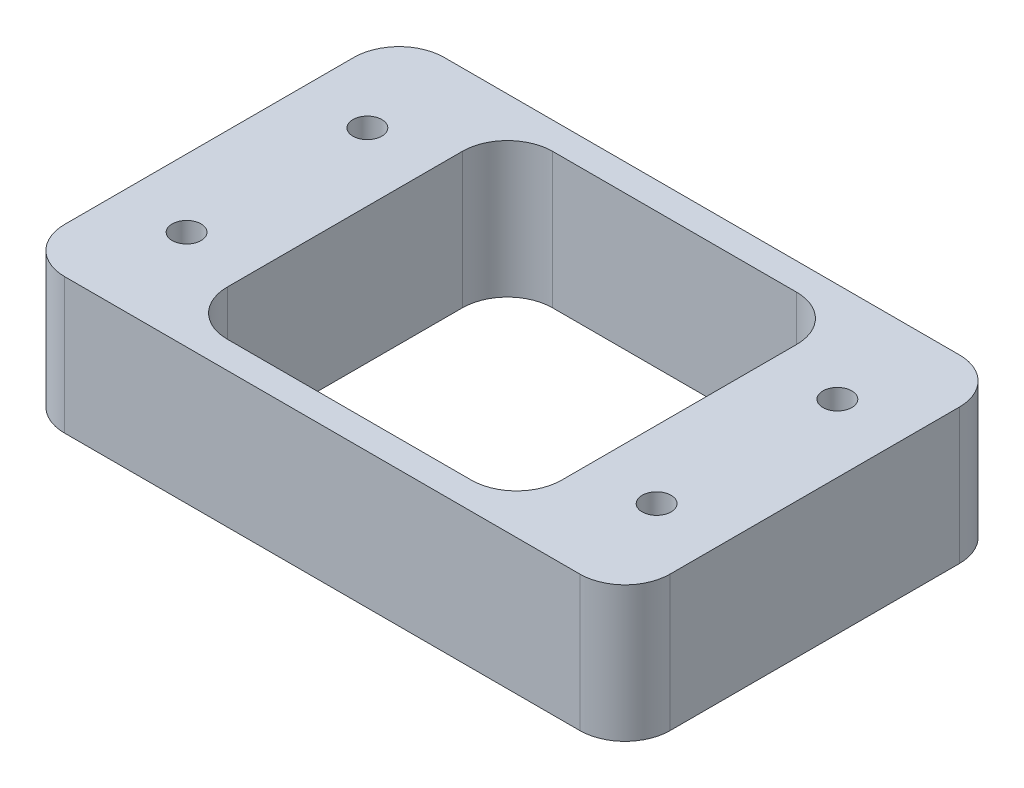
ISO-10303-21;
HEADER;
FILE_DESCRIPTION(('STEP AP214'),'2;1');
FILE_NAME('part.step','',(''),(''),'','','');
FILE_SCHEMA(('AUTOMOTIVE_DESIGN { 1 0 10303 214 1 1 1 1 }'));
ENDSEC;
DATA;
#1=APPLICATION_CONTEXT('core data for automotive mechanical design processes');
#2=APPLICATION_PROTOCOL_DEFINITION('international standard','automotive_design',2000,#1);
#3=PRODUCT_CONTEXT('',#1,'mechanical');
#4=PRODUCT('Part','Part','',(#3));
#5=PRODUCT_RELATED_PRODUCT_CATEGORY('part','',(#4));
#6=PRODUCT_DEFINITION_FORMATION('','',#4);
#7=PRODUCT_DEFINITION_CONTEXT('part definition',#1,'design');
#8=PRODUCT_DEFINITION('design','',#6,#7);
#9=PRODUCT_DEFINITION_SHAPE('','',#8);
#10=(LENGTH_UNIT() NAMED_UNIT(*) SI_UNIT(.MILLI.,.METRE.));
#11=(NAMED_UNIT(*) PLANE_ANGLE_UNIT() SI_UNIT($,.RADIAN.));
#12=(NAMED_UNIT(*) SI_UNIT($,.STERADIAN.) SOLID_ANGLE_UNIT());
#13=UNCERTAINTY_MEASURE_WITH_UNIT(LENGTH_MEASURE(1.E-05),#10,'distance_accuracy_value','');
#14=(GEOMETRIC_REPRESENTATION_CONTEXT(3) GLOBAL_UNCERTAINTY_ASSIGNED_CONTEXT((#13)) GLOBAL_UNIT_ASSIGNED_CONTEXT((#10,
#11,#12)) REPRESENTATION_CONTEXT('',''));
#15=CARTESIAN_POINT('',(0.,0.,0.));
#16=DIRECTION('',(0.,0.,1.));
#17=DIRECTION('',(1.,0.,0.));
#18=AXIS2_PLACEMENT_3D('',#15,#16,#17);
#19=CARTESIAN_POINT('',(0.,15.,0.));
#20=DIRECTION('',(0.,-1.,0.));
#21=DIRECTION('',(0.,0.,-1.));
#22=AXIS2_PLACEMENT_3D('',#19,#20,#21);
#23=PLANE('',#22);
#24=DIRECTION('',(-1.,0.,0.));
#25=VECTOR('',#24,1.);
#26=CARTESIAN_POINT('',(15.,15.,-39.));
#27=LINE('',#26,#25);
#28=CARTESIAN_POINT('',(47.,15.,-39.));
#29=VERTEX_POINT('',#28);
#30=CARTESIAN_POINT('',(20.,15.,-39.));
#31=VERTEX_POINT('',#30);
#32=EDGE_CURVE('E189',#29,#31,#27,.T.);
#33=ORIENTED_EDGE('',*,*,#32,.F.);
#34=CARTESIAN_POINT('',(47.,15.,-34.));
#35=DIRECTION('',(0.,-1.,0.));
#36=DIRECTION('',(0.,0.,-1.));
#37=AXIS2_PLACEMENT_3D('',#34,#35,#36);
#38=CIRCLE('',#37,5.);
#39=CARTESIAN_POINT('',(52.,15.,-34.));
#40=VERTEX_POINT('',#39);
#41=EDGE_CURVE('E187',#29,#40,#38,.T.);
#42=ORIENTED_EDGE('',*,*,#41,.T.);
#43=DIRECTION('',(0.,0.,-1.));
#44=VECTOR('',#43,1.);
#45=CARTESIAN_POINT('',(52.,15.,-3.));
#46=LINE('',#45,#44);
#47=CARTESIAN_POINT('',(52.,15.,-8.));
#48=VERTEX_POINT('',#47);
#49=EDGE_CURVE('E178',#48,#40,#46,.T.);
#50=ORIENTED_EDGE('',*,*,#49,.F.);
#51=CARTESIAN_POINT('',(47.,15.,-8.));
#52=DIRECTION('',(0.,-1.,0.));
#53=DIRECTION('',(0.,0.,-1.));
#54=AXIS2_PLACEMENT_3D('',#51,#52,#53);
#55=CIRCLE('',#54,5.);
#56=CARTESIAN_POINT('',(47.,15.,-3.));
#57=VERTEX_POINT('',#56);
#58=EDGE_CURVE('E160',#48,#57,#55,.T.);
#59=ORIENTED_EDGE('',*,*,#58,.T.);
#60=DIRECTION('',(1.,0.,0.));
#61=VECTOR('',#60,1.);
#62=CARTESIAN_POINT('',(15.,15.,-3.));
#63=LINE('',#62,#61);
#64=CARTESIAN_POINT('',(20.,15.,-3.));
#65=VERTEX_POINT('',#64);
#66=EDGE_CURVE('E202',#65,#57,#63,.T.);
#67=ORIENTED_EDGE('',*,*,#66,.F.);
#68=CARTESIAN_POINT('',(20.,15.,-8.));
#69=DIRECTION('',(0.,-1.,0.));
#70=DIRECTION('',(0.,0.,-1.));
#71=AXIS2_PLACEMENT_3D('',#68,#69,#70);
#72=CIRCLE('',#71,5.);
#73=CARTESIAN_POINT('',(15.,15.,-8.));
#74=VERTEX_POINT('',#73);
#75=EDGE_CURVE('E54',#65,#74,#72,.T.);
#76=ORIENTED_EDGE('',*,*,#75,.T.);
#77=DIRECTION('',(0.,0.,1.));
#78=VECTOR('',#77,1.);
#79=CARTESIAN_POINT('',(15.,15.,-3.));
#80=LINE('',#79,#78);
#81=CARTESIAN_POINT('',(15.,15.,-34.));
#82=VERTEX_POINT('',#81);
#83=EDGE_CURVE('E193',#82,#74,#80,.T.);
#84=ORIENTED_EDGE('',*,*,#83,.F.);
#85=CARTESIAN_POINT('',(20.,15.,-34.));
#86=DIRECTION('',(0.,-1.,0.));
#87=DIRECTION('',(0.,0.,-1.));
#88=AXIS2_PLACEMENT_3D('',#85,#86,#87);
#89=CIRCLE('',#88,5.);
#90=EDGE_CURVE('E338',#82,#31,#89,.T.);
#91=ORIENTED_EDGE('',*,*,#90,.T.);
#92=EDGE_LOOP('',(#33,#42,#50,#59,#67,#76,#84,#91));
#93=FACE_BOUND('',#92,.T.);
#94=DIRECTION('',(-1.,0.,0.));
#95=VECTOR('',#94,1.);
#96=CARTESIAN_POINT('',(0.,15.,-42.));
#97=LINE('',#96,#95);
#98=CARTESIAN_POINT('',(62.,15.,-42.));
#99=VERTEX_POINT('',#98);
#100=CARTESIAN_POINT('',(5.,15.,-42.));
#101=VERTEX_POINT('',#100);
#102=EDGE_CURVE('E249',#99,#101,#97,.T.);
#103=ORIENTED_EDGE('',*,*,#102,.T.);
#104=CARTESIAN_POINT('',(5.,15.,-37.));
#105=DIRECTION('',(0.,-1.,0.));
#106=DIRECTION('',(0.,0.,-1.));
#107=AXIS2_PLACEMENT_3D('',#104,#105,#106);
#108=CIRCLE('',#107,5.);
#109=CARTESIAN_POINT('',(0.,15.,-37.));
#110=VERTEX_POINT('',#109);
#111=EDGE_CURVE('E321',#101,#110,#108,.F.);
#112=ORIENTED_EDGE('',*,*,#111,.T.);
#113=DIRECTION('',(0.,0.,1.));
#114=VECTOR('',#113,1.);
#115=CARTESIAN_POINT('',(0.,15.,0.));
#116=LINE('',#115,#114);
#117=CARTESIAN_POINT('',(0.,15.,-5.));
#118=VERTEX_POINT('',#117);
#119=EDGE_CURVE('E238',#110,#118,#116,.T.);
#120=ORIENTED_EDGE('',*,*,#119,.T.);
#121=CARTESIAN_POINT('',(5.,15.,-5.));
#122=DIRECTION('',(0.,-1.,0.));
#123=DIRECTION('',(0.,0.,-1.));
#124=AXIS2_PLACEMENT_3D('',#121,#122,#123);
#125=CIRCLE('',#124,5.);
#126=CARTESIAN_POINT('',(5.,15.,0.));
#127=VERTEX_POINT('',#126);
#128=EDGE_CURVE('E313',#118,#127,#125,.F.);
#129=ORIENTED_EDGE('',*,*,#128,.T.);
#130=DIRECTION('',(1.,0.,0.));
#131=VECTOR('',#130,1.);
#132=CARTESIAN_POINT('',(0.,15.,0.));
#133=LINE('',#132,#131);
#134=CARTESIAN_POINT('',(62.,15.,0.));
#135=VERTEX_POINT('',#134);
#136=EDGE_CURVE('E242',#127,#135,#133,.T.);
#137=ORIENTED_EDGE('',*,*,#136,.T.);
#138=CARTESIAN_POINT('',(62.,15.,-5.));
#139=DIRECTION('',(0.,-1.,0.));
#140=DIRECTION('',(0.,0.,-1.));
#141=AXIS2_PLACEMENT_3D('',#138,#139,#140);
#142=CIRCLE('',#141,5.);
#143=CARTESIAN_POINT('',(67.,15.,-5.));
#144=VERTEX_POINT('',#143);
#145=EDGE_CURVE('E68',#135,#144,#142,.F.);
#146=ORIENTED_EDGE('',*,*,#145,.T.);
#147=DIRECTION('',(0.,0.,-1.));
#148=VECTOR('',#147,1.);
#149=CARTESIAN_POINT('',(67.,15.,0.));
#150=LINE('',#149,#148);
#151=CARTESIAN_POINT('',(67.,15.,-37.));
#152=VERTEX_POINT('',#151);
#153=EDGE_CURVE('E246',#144,#152,#150,.T.);
#154=ORIENTED_EDGE('',*,*,#153,.T.);
#155=CARTESIAN_POINT('',(62.,15.,-37.));
#156=DIRECTION('',(0.,-1.,0.));
#157=DIRECTION('',(0.,0.,-1.));
#158=AXIS2_PLACEMENT_3D('',#155,#156,#157);
#159=CIRCLE('',#158,5.);
#160=EDGE_CURVE('E318',#152,#99,#159,.F.);
#161=ORIENTED_EDGE('',*,*,#160,.T.);
#162=EDGE_LOOP('',(#103,#112,#120,#129,#137,#146,#154,#161));
#163=FACE_BOUND('',#162,.T.);
#164=CARTESIAN_POINT('',(7.50000000000001,15.,-31.));
#165=DIRECTION('',(0.,1.,0.));
#166=DIRECTION('',(0.,0.,1.));
#167=AXIS2_PLACEMENT_3D('',#164,#165,#166);
#168=CIRCLE('',#167,1.6);
#169=CARTESIAN_POINT('',(7.50000000000001,15.,-29.4));
#170=VERTEX_POINT('',#169);
#171=EDGE_CURVE('E230',#170,#170,#168,.T.);
#172=ORIENTED_EDGE('',*,*,#171,.F.);
#173=EDGE_LOOP('',(#172));
#174=FACE_BOUND('',#173,.T.);
#175=CARTESIAN_POINT('',(7.50000000000001,15.,-11.));
#176=DIRECTION('',(0.,1.,0.));
#177=DIRECTION('',(0.,0.,1.));
#178=AXIS2_PLACEMENT_3D('',#175,#176,#177);
#179=CIRCLE('',#178,1.6);
#180=CARTESIAN_POINT('',(7.50000000000001,15.,-9.4));
#181=VERTEX_POINT('',#180);
#182=EDGE_CURVE('E222',#181,#181,#179,.T.);
#183=ORIENTED_EDGE('',*,*,#182,.F.);
#184=EDGE_LOOP('',(#183));
#185=FACE_BOUND('',#184,.T.);
#186=CARTESIAN_POINT('',(59.5,15.,-11.));
#187=DIRECTION('',(0.,1.,0.));
#188=DIRECTION('',(0.,0.,-1.));
#189=AXIS2_PLACEMENT_3D('',#186,#187,#188);
#190=CIRCLE('',#189,1.6);
#191=CARTESIAN_POINT('',(59.5,15.,-12.6));
#192=VERTEX_POINT('',#191);
#193=EDGE_CURVE('E214',#192,#192,#190,.T.);
#194=ORIENTED_EDGE('',*,*,#193,.F.);
#195=EDGE_LOOP('',(#194));
#196=FACE_BOUND('',#195,.T.);
#197=CARTESIAN_POINT('',(59.5,15.,-31.));
#198=DIRECTION('',(0.,1.,0.));
#199=DIRECTION('',(0.,0.,-1.));
#200=AXIS2_PLACEMENT_3D('',#197,#198,#199);
#201=CIRCLE('',#200,1.6);
#202=CARTESIAN_POINT('',(59.5,15.,-32.6));
#203=VERTEX_POINT('',#202);
#204=EDGE_CURVE('E205',#203,#203,#201,.T.);
#205=ORIENTED_EDGE('',*,*,#204,.F.);
#206=EDGE_LOOP('',(#205));
#207=FACE_BOUND('',#206,.T.);
#208=ADVANCED_FACE('F45',(#93,#163,#174,#185,#196,#207),#23,.F.);
#209=CARTESIAN_POINT('',(0.,0.,0.));
#210=DIRECTION('',(0.,-1.,0.));
#211=DIRECTION('',(0.,0.,-1.));
#212=AXIS2_PLACEMENT_3D('',#209,#210,#211);
#213=PLANE('',#212);
#214=DIRECTION('',(1.,0.,0.));
#215=VECTOR('',#214,1.);
#216=CARTESIAN_POINT('',(15.,0.,-3.));
#217=LINE('',#216,#215);
#218=CARTESIAN_POINT('',(20.,0.,-3.));
#219=VERTEX_POINT('',#218);
#220=CARTESIAN_POINT('',(47.,0.,-3.));
#221=VERTEX_POINT('',#220);
#222=EDGE_CURVE('E196',#219,#221,#217,.T.);
#223=ORIENTED_EDGE('',*,*,#222,.T.);
#224=CARTESIAN_POINT('',(47.,0.,-8.));
#225=DIRECTION('',(0.,-1.,0.));
#226=DIRECTION('',(0.,0.,-1.));
#227=AXIS2_PLACEMENT_3D('',#224,#225,#226);
#228=CIRCLE('',#227,5.);
#229=CARTESIAN_POINT('',(52.,0.,-8.));
#230=VERTEX_POINT('',#229);
#231=EDGE_CURVE('E171',#221,#230,#228,.F.);
#232=ORIENTED_EDGE('',*,*,#231,.T.);
#233=DIRECTION('',(0.,0.,-1.));
#234=VECTOR('',#233,1.);
#235=CARTESIAN_POINT('',(52.,0.,-3.));
#236=LINE('',#235,#234);
#237=CARTESIAN_POINT('',(52.,0.,-34.));
#238=VERTEX_POINT('',#237);
#239=EDGE_CURVE('E181',#230,#238,#236,.T.);
#240=ORIENTED_EDGE('',*,*,#239,.T.);
#241=CARTESIAN_POINT('',(47.,0.,-34.));
#242=DIRECTION('',(0.,-1.,0.));
#243=DIRECTION('',(0.,0.,-1.));
#244=AXIS2_PLACEMENT_3D('',#241,#242,#243);
#245=CIRCLE('',#244,5.);
#246=CARTESIAN_POINT('',(47.,0.,-39.));
#247=VERTEX_POINT('',#246);
#248=EDGE_CURVE('E346',#238,#247,#245,.F.);
#249=ORIENTED_EDGE('',*,*,#248,.T.);
#250=DIRECTION('',(-1.,0.,0.));
#251=VECTOR('',#250,1.);
#252=CARTESIAN_POINT('',(15.,0.,-39.));
#253=LINE('',#252,#251);
#254=CARTESIAN_POINT('',(20.,0.,-39.));
#255=VERTEX_POINT('',#254);
#256=EDGE_CURVE('E370',#247,#255,#253,.T.);
#257=ORIENTED_EDGE('',*,*,#256,.T.);
#258=CARTESIAN_POINT('',(20.,0.,-34.));
#259=DIRECTION('',(0.,-1.,0.));
#260=DIRECTION('',(0.,0.,-1.));
#261=AXIS2_PLACEMENT_3D('',#258,#259,#260);
#262=CIRCLE('',#261,5.);
#263=CARTESIAN_POINT('',(15.,0.,-34.));
#264=VERTEX_POINT('',#263);
#265=EDGE_CURVE('E341',#255,#264,#262,.F.);
#266=ORIENTED_EDGE('',*,*,#265,.T.);
#267=DIRECTION('',(0.,0.,1.));
#268=VECTOR('',#267,1.);
#269=CARTESIAN_POINT('',(15.,0.,-3.));
#270=LINE('',#269,#268);
#271=CARTESIAN_POINT('',(15.,0.,-8.));
#272=VERTEX_POINT('',#271);
#273=EDGE_CURVE('E365',#264,#272,#270,.T.);
#274=ORIENTED_EDGE('',*,*,#273,.T.);
#275=CARTESIAN_POINT('',(20.,0.,-8.));
#276=DIRECTION('',(0.,-1.,0.));
#277=DIRECTION('',(0.,0.,-1.));
#278=AXIS2_PLACEMENT_3D('',#275,#276,#277);
#279=CIRCLE('',#278,5.);
#280=EDGE_CURVE('E11',#272,#219,#279,.F.);
#281=ORIENTED_EDGE('',*,*,#280,.T.);
#282=EDGE_LOOP('',(#223,#232,#240,#249,#257,#266,#274,#281));
#283=FACE_BOUND('',#282,.T.);
#284=CARTESIAN_POINT('',(59.5,0.,-11.));
#285=DIRECTION('',(0.,1.,0.));
#286=DIRECTION('',(0.,0.,-1.));
#287=AXIS2_PLACEMENT_3D('',#284,#285,#286);
#288=CIRCLE('',#287,1.6);
#289=CARTESIAN_POINT('',(59.5,0.,-12.6));
#290=VERTEX_POINT('',#289);
#291=EDGE_CURVE('E209',#290,#290,#288,.T.);
#292=ORIENTED_EDGE('',*,*,#291,.T.);
#293=EDGE_LOOP('',(#292));
#294=FACE_BOUND('',#293,.T.);
#295=CARTESIAN_POINT('',(7.50000000000001,0.,-31.));
#296=DIRECTION('',(0.,1.,0.));
#297=DIRECTION('',(0.,0.,1.));
#298=AXIS2_PLACEMENT_3D('',#295,#296,#297);
#299=CIRCLE('',#298,1.6);
#300=CARTESIAN_POINT('',(7.50000000000001,0.,-29.4));
#301=VERTEX_POINT('',#300);
#302=EDGE_CURVE('E226',#301,#301,#299,.T.);
#303=ORIENTED_EDGE('',*,*,#302,.T.);
#304=EDGE_LOOP('',(#303));
#305=FACE_BOUND('',#304,.T.);
#306=DIRECTION('',(0.,0.,1.));
#307=VECTOR('',#306,1.);
#308=CARTESIAN_POINT('',(0.,0.,0.));
#309=LINE('',#308,#307);
#310=CARTESIAN_POINT('',(0.,0.,-37.));
#311=VERTEX_POINT('',#310);
#312=CARTESIAN_POINT('',(0.,0.,-5.));
#313=VERTEX_POINT('',#312);
#314=EDGE_CURVE('E234',#311,#313,#309,.T.);
#315=ORIENTED_EDGE('',*,*,#314,.F.);
#316=CARTESIAN_POINT('',(5.,0.,-37.));
#317=DIRECTION('',(0.,-1.,0.));
#318=DIRECTION('',(0.,0.,-1.));
#319=AXIS2_PLACEMENT_3D('',#316,#317,#318);
#320=CIRCLE('',#319,5.);
#321=CARTESIAN_POINT('',(5.,0.,-42.));
#322=VERTEX_POINT('',#321);
#323=EDGE_CURVE('E303',#311,#322,#320,.T.);
#324=ORIENTED_EDGE('',*,*,#323,.T.);
#325=DIRECTION('',(-1.,0.,0.));
#326=VECTOR('',#325,1.);
#327=CARTESIAN_POINT('',(0.,0.,-42.));
#328=LINE('',#327,#326);
#329=CARTESIAN_POINT('',(62.,0.,-42.));
#330=VERTEX_POINT('',#329);
#331=EDGE_CURVE('E243',#330,#322,#328,.T.);
#332=ORIENTED_EDGE('',*,*,#331,.F.);
#333=CARTESIAN_POINT('',(62.,0.,-37.));
#334=DIRECTION('',(0.,-1.,0.));
#335=DIRECTION('',(0.,0.,-1.));
#336=AXIS2_PLACEMENT_3D('',#333,#334,#335);
#337=CIRCLE('',#336,5.);
#338=CARTESIAN_POINT('',(67.,0.,-37.));
#339=VERTEX_POINT('',#338);
#340=EDGE_CURVE('E300',#330,#339,#337,.T.);
#341=ORIENTED_EDGE('',*,*,#340,.T.);
#342=DIRECTION('',(0.,0.,-1.));
#343=VECTOR('',#342,1.);
#344=CARTESIAN_POINT('',(67.,0.,0.));
#345=LINE('',#344,#343);
#346=CARTESIAN_POINT('',(67.,0.,-5.));
#347=VERTEX_POINT('',#346);
#348=EDGE_CURVE('E260',#347,#339,#345,.T.);
#349=ORIENTED_EDGE('',*,*,#348,.F.);
#350=CARTESIAN_POINT('',(62.,0.,-5.));
#351=DIRECTION('',(0.,-1.,0.));
#352=DIRECTION('',(0.,0.,-1.));
#353=AXIS2_PLACEMENT_3D('',#350,#351,#352);
#354=CIRCLE('',#353,5.);
#355=CARTESIAN_POINT('',(62.,0.,0.));
#356=VERTEX_POINT('',#355);
#357=EDGE_CURVE('E297',#347,#356,#354,.T.);
#358=ORIENTED_EDGE('',*,*,#357,.T.);
#359=DIRECTION('',(1.,0.,0.));
#360=VECTOR('',#359,1.);
#361=CARTESIAN_POINT('',(0.,0.,0.));
#362=LINE('',#361,#360);
#363=CARTESIAN_POINT('',(5.,0.,0.));
#364=VERTEX_POINT('',#363);
#365=EDGE_CURVE('E256',#364,#356,#362,.T.);
#366=ORIENTED_EDGE('',*,*,#365,.F.);
#367=CARTESIAN_POINT('',(5.,0.,-5.));
#368=DIRECTION('',(0.,-1.,0.));
#369=DIRECTION('',(0.,0.,-1.));
#370=AXIS2_PLACEMENT_3D('',#367,#368,#369);
#371=CIRCLE('',#370,5.);
#372=EDGE_CURVE('E294',#364,#313,#371,.T.);
#373=ORIENTED_EDGE('',*,*,#372,.T.);
#374=EDGE_LOOP('',(#315,#324,#332,#341,#349,#358,#366,#373));
#375=FACE_BOUND('',#374,.T.);
#376=CARTESIAN_POINT('',(7.50000000000001,0.,-11.));
#377=DIRECTION('',(0.,1.,0.));
#378=DIRECTION('',(0.,0.,1.));
#379=AXIS2_PLACEMENT_3D('',#376,#377,#378);
#380=CIRCLE('',#379,1.6);
#381=CARTESIAN_POINT('',(7.50000000000001,0.,-9.4));
#382=VERTEX_POINT('',#381);
#383=EDGE_CURVE('E218',#382,#382,#380,.T.);
#384=ORIENTED_EDGE('',*,*,#383,.T.);
#385=EDGE_LOOP('',(#384));
#386=FACE_BOUND('',#385,.T.);
#387=CARTESIAN_POINT('',(59.5,0.,-31.));
#388=DIRECTION('',(0.,1.,0.));
#389=DIRECTION('',(0.,0.,-1.));
#390=AXIS2_PLACEMENT_3D('',#387,#388,#389);
#391=CIRCLE('',#390,1.6);
#392=CARTESIAN_POINT('',(59.5,0.,-32.6));
#393=VERTEX_POINT('',#392);
#394=EDGE_CURVE('E210',#393,#393,#391,.T.);
#395=ORIENTED_EDGE('',*,*,#394,.T.);
#396=EDGE_LOOP('',(#395));
#397=FACE_BOUND('',#396,.T.);
#398=ADVANCED_FACE('F363',(#283,#294,#305,#375,#386,#397),#213,.T.);
#399=CARTESIAN_POINT('',(0.,15.,0.));
#400=DIRECTION('',(1.,0.,0.));
#401=DIRECTION('',(0.,0.,-1.));
#402=AXIS2_PLACEMENT_3D('',#399,#400,#401);
#403=PLANE('',#402);
#404=ORIENTED_EDGE('',*,*,#119,.F.);
#405=DIRECTION('',(0.,-1.,0.));
#406=VECTOR('',#405,1.);
#407=CARTESIAN_POINT('',(0.,15.,-37.));
#408=LINE('',#407,#406);
#409=EDGE_CURVE('E290',#110,#311,#408,.T.);
#410=ORIENTED_EDGE('',*,*,#409,.T.);
#411=ORIENTED_EDGE('',*,*,#314,.T.);
#412=DIRECTION('',(0.,-1.,0.));
#413=VECTOR('',#412,1.);
#414=CARTESIAN_POINT('',(0.,15.,-5.));
#415=LINE('',#414,#413);
#416=EDGE_CURVE('E287',#313,#118,#415,.F.);
#417=ORIENTED_EDGE('',*,*,#416,.T.);
#418=EDGE_LOOP('',(#404,#410,#411,#417));
#419=FACE_BOUND('',#418,.T.);
#420=ADVANCED_FACE('F401',(#419),#403,.F.);
#421=CARTESIAN_POINT('',(0.,15.,0.));
#422=DIRECTION('',(0.,0.,-1.));
#423=DIRECTION('',(-1.,0.,0.));
#424=AXIS2_PLACEMENT_3D('',#421,#422,#423);
#425=PLANE('',#424);
#426=ORIENTED_EDGE('',*,*,#365,.T.);
#427=DIRECTION('',(0.,-1.,0.));
#428=VECTOR('',#427,1.);
#429=CARTESIAN_POINT('',(62.,15.,0.));
#430=LINE('',#429,#428);
#431=EDGE_CURVE('E172',#356,#135,#430,.F.);
#432=ORIENTED_EDGE('',*,*,#431,.T.);
#433=ORIENTED_EDGE('',*,*,#136,.F.);
#434=DIRECTION('',(0.,-1.,0.));
#435=VECTOR('',#434,1.);
#436=CARTESIAN_POINT('',(5.,15.,0.));
#437=LINE('',#436,#435);
#438=EDGE_CURVE('E330',#127,#364,#437,.T.);
#439=ORIENTED_EDGE('',*,*,#438,.T.);
#440=EDGE_LOOP('',(#426,#432,#433,#439));
#441=FACE_BOUND('',#440,.T.);
#442=ADVANCED_FACE('F414',(#441),#425,.F.);
#443=CARTESIAN_POINT('',(67.,15.,0.));
#444=DIRECTION('',(-1.,0.,0.));
#445=DIRECTION('',(0.,0.,1.));
#446=AXIS2_PLACEMENT_3D('',#443,#444,#445);
#447=PLANE('',#446);
#448=ORIENTED_EDGE('',*,*,#348,.T.);
#449=DIRECTION('',(0.,-1.,0.));
#450=VECTOR('',#449,1.);
#451=CARTESIAN_POINT('',(67.,15.,-37.));
#452=LINE('',#451,#450);
#453=EDGE_CURVE('E61',#339,#152,#452,.F.);
#454=ORIENTED_EDGE('',*,*,#453,.T.);
#455=ORIENTED_EDGE('',*,*,#153,.F.);
#456=DIRECTION('',(0.,-1.,0.));
#457=VECTOR('',#456,1.);
#458=CARTESIAN_POINT('',(67.,15.,-5.));
#459=LINE('',#458,#457);
#460=EDGE_CURVE('E324',#144,#347,#459,.T.);
#461=ORIENTED_EDGE('',*,*,#460,.T.);
#462=EDGE_LOOP('',(#448,#454,#455,#461));
#463=FACE_BOUND('',#462,.T.);
#464=ADVANCED_FACE('F410',(#463),#447,.F.);
#465=CARTESIAN_POINT('',(0.,15.,-42.));
#466=DIRECTION('',(0.,0.,1.));
#467=DIRECTION('',(1.,0.,0.));
#468=AXIS2_PLACEMENT_3D('',#465,#466,#467);
#469=PLANE('',#468);
#470=ORIENTED_EDGE('',*,*,#331,.T.);
#471=DIRECTION('',(0.,-1.,0.));
#472=VECTOR('',#471,1.);
#473=CARTESIAN_POINT('',(5.,15.,-42.));
#474=LINE('',#473,#472);
#475=EDGE_CURVE('E310',#322,#101,#474,.F.);
#476=ORIENTED_EDGE('',*,*,#475,.T.);
#477=ORIENTED_EDGE('',*,*,#102,.F.);
#478=DIRECTION('',(0.,-1.,0.));
#479=VECTOR('',#478,1.);
#480=CARTESIAN_POINT('',(62.,15.,-42.));
#481=LINE('',#480,#479);
#482=EDGE_CURVE('E306',#99,#330,#481,.T.);
#483=ORIENTED_EDGE('',*,*,#482,.T.);
#484=EDGE_LOOP('',(#470,#476,#477,#483));
#485=FACE_BOUND('',#484,.T.);
#486=ADVANCED_FACE('F407',(#485),#469,.F.);
#487=CARTESIAN_POINT('',(7.50000000000001,15.,-31.));
#488=DIRECTION('',(0.,-1.,0.));
#489=DIRECTION('',(0.,0.,-1.));
#490=AXIS2_PLACEMENT_3D('',#487,#488,#489);
#491=CYLINDRICAL_SURFACE('',#490,1.6);
#492=ORIENTED_EDGE('',*,*,#171,.T.);
#493=EDGE_LOOP('',(#492));
#494=FACE_BOUND('',#493,.T.);
#495=ORIENTED_EDGE('',*,*,#302,.F.);
#496=EDGE_LOOP('',(#495));
#497=FACE_BOUND('',#496,.T.);
#498=ADVANCED_FACE('F404',(#494,#497),#491,.F.);
#499=CARTESIAN_POINT('',(7.50000000000001,15.,-11.));
#500=DIRECTION('',(0.,-1.,0.));
#501=DIRECTION('',(0.,0.,-1.));
#502=AXIS2_PLACEMENT_3D('',#499,#500,#501);
#503=CYLINDRICAL_SURFACE('',#502,1.6);
#504=ORIENTED_EDGE('',*,*,#182,.T.);
#505=EDGE_LOOP('',(#504));
#506=FACE_BOUND('',#505,.T.);
#507=ORIENTED_EDGE('',*,*,#383,.F.);
#508=EDGE_LOOP('',(#507));
#509=FACE_BOUND('',#508,.T.);
#510=ADVANCED_FACE('F468',(#506,#509),#503,.F.);
#511=CARTESIAN_POINT('',(59.5,15.,-11.));
#512=DIRECTION('',(0.,-1.,0.));
#513=DIRECTION('',(0.,0.,-1.));
#514=AXIS2_PLACEMENT_3D('',#511,#512,#513);
#515=CYLINDRICAL_SURFACE('',#514,1.6);
#516=ORIENTED_EDGE('',*,*,#193,.T.);
#517=EDGE_LOOP('',(#516));
#518=FACE_BOUND('',#517,.T.);
#519=ORIENTED_EDGE('',*,*,#291,.F.);
#520=EDGE_LOOP('',(#519));
#521=FACE_BOUND('',#520,.T.);
#522=ADVANCED_FACE('F459',(#518,#521),#515,.F.);
#523=CARTESIAN_POINT('',(59.5,15.,-31.));
#524=DIRECTION('',(0.,-1.,0.));
#525=DIRECTION('',(0.,0.,-1.));
#526=AXIS2_PLACEMENT_3D('',#523,#524,#525);
#527=CYLINDRICAL_SURFACE('',#526,1.6);
#528=ORIENTED_EDGE('',*,*,#204,.T.);
#529=EDGE_LOOP('',(#528));
#530=FACE_BOUND('',#529,.T.);
#531=ORIENTED_EDGE('',*,*,#394,.F.);
#532=EDGE_LOOP('',(#531));
#533=FACE_BOUND('',#532,.T.);
#534=ADVANCED_FACE('F457',(#530,#533),#527,.F.);
#535=CARTESIAN_POINT('',(52.,0.,-3.));
#536=DIRECTION('',(1.,0.,0.));
#537=DIRECTION('',(0.,0.,-1.));
#538=AXIS2_PLACEMENT_3D('',#535,#536,#537);
#539=PLANE('',#538);
#540=ORIENTED_EDGE('',*,*,#239,.F.);
#541=DIRECTION('',(0.,1.,0.));
#542=VECTOR('',#541,1.);
#543=CARTESIAN_POINT('',(52.,15.,-8.));
#544=LINE('',#543,#542);
#545=EDGE_CURVE('E164',#230,#48,#544,.T.);
#546=ORIENTED_EDGE('',*,*,#545,.T.);
#547=ORIENTED_EDGE('',*,*,#49,.T.);
#548=DIRECTION('',(0.,1.,0.));
#549=VECTOR('',#548,1.);
#550=CARTESIAN_POINT('',(52.,0.,-34.));
#551=LINE('',#550,#549);
#552=EDGE_CURVE('E184',#40,#238,#551,.F.);
#553=ORIENTED_EDGE('',*,*,#552,.T.);
#554=EDGE_LOOP('',(#540,#546,#547,#553));
#555=FACE_BOUND('',#554,.T.);
#556=ADVANCED_FACE('F177',(#555),#539,.F.);
#557=CARTESIAN_POINT('',(15.,0.,-3.));
#558=DIRECTION('',(0.,0.,1.));
#559=DIRECTION('',(1.,0.,0.));
#560=AXIS2_PLACEMENT_3D('',#557,#558,#559);
#561=PLANE('',#560);
#562=ORIENTED_EDGE('',*,*,#66,.T.);
#563=DIRECTION('',(0.,1.,0.));
#564=VECTOR('',#563,1.);
#565=CARTESIAN_POINT('',(47.,0.,-3.));
#566=LINE('',#565,#564);
#567=EDGE_CURVE('E165',#57,#221,#566,.F.);
#568=ORIENTED_EDGE('',*,*,#567,.T.);
#569=ORIENTED_EDGE('',*,*,#222,.F.);
#570=DIRECTION('',(0.,1.,0.));
#571=VECTOR('',#570,1.);
#572=CARTESIAN_POINT('',(20.,15.,-3.));
#573=LINE('',#572,#571);
#574=EDGE_CURVE('E183',#219,#65,#573,.T.);
#575=ORIENTED_EDGE('',*,*,#574,.T.);
#576=EDGE_LOOP('',(#562,#568,#569,#575));
#577=FACE_BOUND('',#576,.T.);
#578=ADVANCED_FACE('F367',(#577),#561,.F.);
#579=CARTESIAN_POINT('',(15.,0.,-3.));
#580=DIRECTION('',(-1.,0.,0.));
#581=DIRECTION('',(0.,0.,1.));
#582=AXIS2_PLACEMENT_3D('',#579,#580,#581);
#583=PLANE('',#582);
#584=ORIENTED_EDGE('',*,*,#273,.F.);
#585=DIRECTION('',(0.,1.,0.));
#586=VECTOR('',#585,1.);
#587=CARTESIAN_POINT('',(15.,15.,-34.));
#588=LINE('',#587,#586);
#589=EDGE_CURVE('E276',#264,#82,#588,.T.);
#590=ORIENTED_EDGE('',*,*,#589,.T.);
#591=ORIENTED_EDGE('',*,*,#83,.T.);
#592=DIRECTION('',(0.,1.,0.));
#593=VECTOR('',#592,1.);
#594=CARTESIAN_POINT('',(15.,0.,-8.));
#595=LINE('',#594,#593);
#596=EDGE_CURVE('E273',#74,#272,#595,.F.);
#597=ORIENTED_EDGE('',*,*,#596,.T.);
#598=EDGE_LOOP('',(#584,#590,#591,#597));
#599=FACE_BOUND('',#598,.T.);
#600=ADVANCED_FACE('F355',(#599),#583,.F.);
#601=CARTESIAN_POINT('',(15.,0.,-39.));
#602=DIRECTION('',(0.,0.,-1.));
#603=DIRECTION('',(-1.,0.,0.));
#604=AXIS2_PLACEMENT_3D('',#601,#602,#603);
#605=PLANE('',#604);
#606=ORIENTED_EDGE('',*,*,#32,.T.);
#607=DIRECTION('',(0.,1.,0.));
#608=VECTOR('',#607,1.);
#609=CARTESIAN_POINT('',(20.,0.,-39.));
#610=LINE('',#609,#608);
#611=EDGE_CURVE('E284',#31,#255,#610,.F.);
#612=ORIENTED_EDGE('',*,*,#611,.T.);
#613=ORIENTED_EDGE('',*,*,#256,.F.);
#614=DIRECTION('',(0.,1.,0.));
#615=VECTOR('',#614,1.);
#616=CARTESIAN_POINT('',(47.,15.,-39.));
#617=LINE('',#616,#615);
#618=EDGE_CURVE('E280',#247,#29,#617,.T.);
#619=ORIENTED_EDGE('',*,*,#618,.T.);
#620=EDGE_LOOP('',(#606,#612,#613,#619));
#621=FACE_BOUND('',#620,.T.);
#622=ADVANCED_FACE('F382',(#621),#605,.F.);
#623=CARTESIAN_POINT('',(47.,0.,-8.));
#624=DIRECTION('',(0.,-1.,0.));
#625=DIRECTION('',(0.,0.,-1.));
#626=AXIS2_PLACEMENT_3D('',#623,#624,#625);
#627=CYLINDRICAL_SURFACE('',#626,5.);
#628=ORIENTED_EDGE('',*,*,#231,.F.);
#629=ORIENTED_EDGE('',*,*,#567,.F.);
#630=ORIENTED_EDGE('',*,*,#58,.F.);
#631=ORIENTED_EDGE('',*,*,#545,.F.);
#632=EDGE_LOOP('',(#628,#629,#630,#631));
#633=FACE_BOUND('',#632,.T.);
#634=ADVANCED_FACE('F163',(#633),#627,.F.);
#635=CARTESIAN_POINT('',(20.,0.,-34.));
#636=DIRECTION('',(0.,-1.,0.));
#637=DIRECTION('',(0.,0.,-1.));
#638=AXIS2_PLACEMENT_3D('',#635,#636,#637);
#639=CYLINDRICAL_SURFACE('',#638,5.);
#640=ORIENTED_EDGE('',*,*,#265,.F.);
#641=ORIENTED_EDGE('',*,*,#611,.F.);
#642=ORIENTED_EDGE('',*,*,#90,.F.);
#643=ORIENTED_EDGE('',*,*,#589,.F.);
#644=EDGE_LOOP('',(#640,#641,#642,#643));
#645=FACE_BOUND('',#644,.T.);
#646=ADVANCED_FACE('F386',(#645),#639,.F.);
#647=CARTESIAN_POINT('',(47.,0.,-34.));
#648=DIRECTION('',(0.,-1.,0.));
#649=DIRECTION('',(0.,0.,-1.));
#650=AXIS2_PLACEMENT_3D('',#647,#648,#649);
#651=CYLINDRICAL_SURFACE('',#650,5.);
#652=ORIENTED_EDGE('',*,*,#248,.F.);
#653=ORIENTED_EDGE('',*,*,#552,.F.);
#654=ORIENTED_EDGE('',*,*,#41,.F.);
#655=ORIENTED_EDGE('',*,*,#618,.F.);
#656=EDGE_LOOP('',(#652,#653,#654,#655));
#657=FACE_BOUND('',#656,.T.);
#658=ADVANCED_FACE('F380',(#657),#651,.F.);
#659=CARTESIAN_POINT('',(20.,0.,-8.));
#660=DIRECTION('',(0.,-1.,0.));
#661=DIRECTION('',(0.,0.,-1.));
#662=AXIS2_PLACEMENT_3D('',#659,#660,#661);
#663=CYLINDRICAL_SURFACE('',#662,5.);
#664=ORIENTED_EDGE('',*,*,#280,.F.);
#665=ORIENTED_EDGE('',*,*,#596,.F.);
#666=ORIENTED_EDGE('',*,*,#75,.F.);
#667=ORIENTED_EDGE('',*,*,#574,.F.);
#668=EDGE_LOOP('',(#664,#665,#666,#667));
#669=FACE_BOUND('',#668,.T.);
#670=ADVANCED_FACE('F359',(#669),#663,.F.);
#671=CARTESIAN_POINT('',(5.,15.,-37.));
#672=DIRECTION('',(0.,-1.,0.));
#673=DIRECTION('',(0.,0.,-1.));
#674=AXIS2_PLACEMENT_3D('',#671,#672,#673);
#675=CYLINDRICAL_SURFACE('',#674,5.);
#676=ORIENTED_EDGE('',*,*,#111,.F.);
#677=ORIENTED_EDGE('',*,*,#475,.F.);
#678=ORIENTED_EDGE('',*,*,#323,.F.);
#679=ORIENTED_EDGE('',*,*,#409,.F.);
#680=EDGE_LOOP('',(#676,#677,#678,#679));
#681=FACE_BOUND('',#680,.T.);
#682=ADVANCED_FACE('F429',(#681),#675,.T.);
#683=CARTESIAN_POINT('',(62.,15.,-37.));
#684=DIRECTION('',(0.,-1.,0.));
#685=DIRECTION('',(0.,0.,-1.));
#686=AXIS2_PLACEMENT_3D('',#683,#684,#685);
#687=CYLINDRICAL_SURFACE('',#686,5.);
#688=ORIENTED_EDGE('',*,*,#160,.F.);
#689=ORIENTED_EDGE('',*,*,#453,.F.);
#690=ORIENTED_EDGE('',*,*,#340,.F.);
#691=ORIENTED_EDGE('',*,*,#482,.F.);
#692=EDGE_LOOP('',(#688,#689,#690,#691));
#693=FACE_BOUND('',#692,.T.);
#694=ADVANCED_FACE('F438',(#693),#687,.T.);
#695=CARTESIAN_POINT('',(62.,15.,-5.));
#696=DIRECTION('',(0.,-1.,0.));
#697=DIRECTION('',(0.,0.,-1.));
#698=AXIS2_PLACEMENT_3D('',#695,#696,#697);
#699=CYLINDRICAL_SURFACE('',#698,5.);
#700=ORIENTED_EDGE('',*,*,#145,.F.);
#701=ORIENTED_EDGE('',*,*,#431,.F.);
#702=ORIENTED_EDGE('',*,*,#357,.F.);
#703=ORIENTED_EDGE('',*,*,#460,.F.);
#704=EDGE_LOOP('',(#700,#701,#702,#703));
#705=FACE_BOUND('',#704,.T.);
#706=ADVANCED_FACE('F442',(#705),#699,.T.);
#707=CARTESIAN_POINT('',(5.,15.,-5.));
#708=DIRECTION('',(0.,-1.,0.));
#709=DIRECTION('',(0.,0.,-1.));
#710=AXIS2_PLACEMENT_3D('',#707,#708,#709);
#711=CYLINDRICAL_SURFACE('',#710,5.);
#712=ORIENTED_EDGE('',*,*,#128,.F.);
#713=ORIENTED_EDGE('',*,*,#416,.F.);
#714=ORIENTED_EDGE('',*,*,#372,.F.);
#715=ORIENTED_EDGE('',*,*,#438,.F.);
#716=EDGE_LOOP('',(#712,#713,#714,#715));
#717=FACE_BOUND('',#716,.T.);
#718=ADVANCED_FACE('F47',(#717),#711,.T.);
#719=CLOSED_SHELL('',(#208,#398,#420,#442,#464,#486,#498,#510,#522,#534,#556,#578,#600,#622,
#634,#646,#658,#670,#682,#694,#706,#718));
#720=MANIFOLD_SOLID_BREP('B2',#719);
#721=ADVANCED_BREP_SHAPE_REPRESENTATION('',(#18,#720),#14);
#722=SHAPE_DEFINITION_REPRESENTATION(#9,#721);
ENDSEC;
END-ISO-10303-21;
